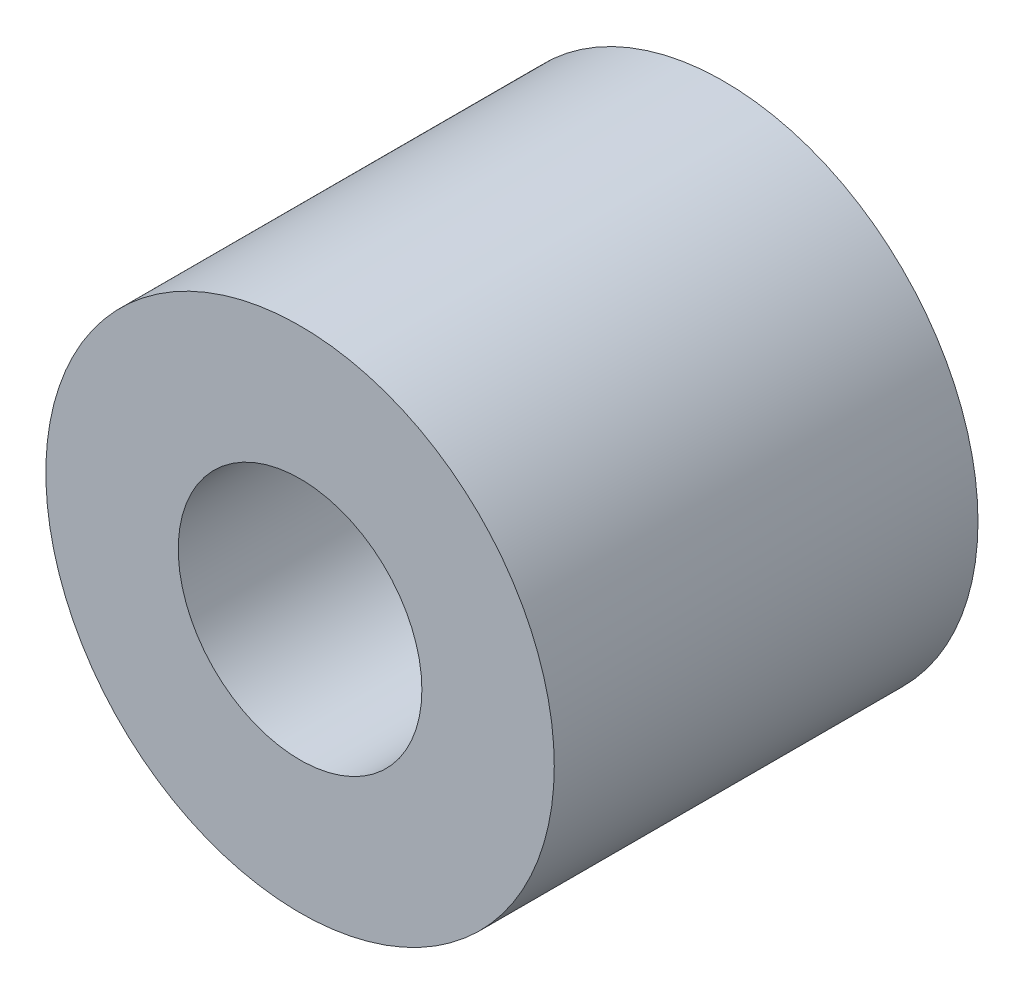
ISO-10303-21;
HEADER;
FILE_DESCRIPTION(('STEP AP214'),'2;1');
FILE_NAME('part.step','',(''),(''),'','','');
FILE_SCHEMA(('AUTOMOTIVE_DESIGN { 1 0 10303 214 1 1 1 1 }'));
ENDSEC;
DATA;
#1=APPLICATION_CONTEXT('core data for automotive mechanical design processes');
#2=APPLICATION_PROTOCOL_DEFINITION('international standard','automotive_design',2000,#1);
#3=PRODUCT_CONTEXT('',#1,'mechanical');
#4=PRODUCT('Part','Part','',(#3));
#5=PRODUCT_RELATED_PRODUCT_CATEGORY('part','',(#4));
#6=PRODUCT_DEFINITION_FORMATION('','',#4);
#7=PRODUCT_DEFINITION_CONTEXT('part definition',#1,'design');
#8=PRODUCT_DEFINITION('design','',#6,#7);
#9=PRODUCT_DEFINITION_SHAPE('','',#8);
#10=(LENGTH_UNIT() NAMED_UNIT(*) SI_UNIT(.MILLI.,.METRE.));
#11=(NAMED_UNIT(*) PLANE_ANGLE_UNIT() SI_UNIT($,.RADIAN.));
#12=(NAMED_UNIT(*) SI_UNIT($,.STERADIAN.) SOLID_ANGLE_UNIT());
#13=UNCERTAINTY_MEASURE_WITH_UNIT(LENGTH_MEASURE(1.E-05),#10,'distance_accuracy_value','');
#14=(GEOMETRIC_REPRESENTATION_CONTEXT(3) GLOBAL_UNCERTAINTY_ASSIGNED_CONTEXT((#13)) GLOBAL_UNIT_ASSIGNED_CONTEXT((#10,
#11,#12)) REPRESENTATION_CONTEXT('',''));
#15=CARTESIAN_POINT('',(0.,0.,0.));
#16=DIRECTION('',(0.,0.,1.));
#17=DIRECTION('',(1.,0.,0.));
#18=AXIS2_PLACEMENT_3D('',#15,#16,#17);
#19=CARTESIAN_POINT('',(0.,0.,4.));
#20=DIRECTION('',(0.,0.,1.));
#21=DIRECTION('',(1.,0.,0.));
#22=AXIS2_PLACEMENT_3D('',#19,#20,#21);
#23=PLANE('',#22);
#24=CARTESIAN_POINT('',(0.,0.,4.));
#25=DIRECTION('',(0.,0.,1.));
#26=DIRECTION('',(1.,0.,0.));
#27=AXIS2_PLACEMENT_3D('',#24,#25,#26);
#28=CIRCLE('',#27,2.4);
#29=CARTESIAN_POINT('',(2.4,0.,4.));
#30=VERTEX_POINT('',#29);
#31=EDGE_CURVE('E10',#30,#30,#28,.T.);
#32=ORIENTED_EDGE('',*,*,#31,.T.);
#33=EDGE_LOOP('',(#32));
#34=FACE_BOUND('',#33,.T.);
#35=CARTESIAN_POINT('',(0.,0.,4.));
#36=DIRECTION('',(0.,0.,1.));
#37=DIRECTION('',(1.,0.,0.));
#38=AXIS2_PLACEMENT_3D('',#35,#36,#37);
#39=CIRCLE('',#38,1.15);
#40=CARTESIAN_POINT('',(1.15,0.,4.));
#41=VERTEX_POINT('',#40);
#42=EDGE_CURVE('E50',#41,#41,#39,.T.);
#43=ORIENTED_EDGE('',*,*,#42,.F.);
#44=EDGE_LOOP('',(#43));
#45=FACE_BOUND('',#44,.T.);
#46=ADVANCED_FACE('F37',(#34,#45),#23,.T.);
#47=CARTESIAN_POINT('',(0.,0.,0.));
#48=DIRECTION('',(0.,0.,1.));
#49=DIRECTION('',(1.,0.,0.));
#50=AXIS2_PLACEMENT_3D('',#47,#48,#49);
#51=PLANE('',#50);
#52=CARTESIAN_POINT('',(0.,0.,0.));
#53=DIRECTION('',(0.,0.,1.));
#54=DIRECTION('',(1.,0.,0.));
#55=AXIS2_PLACEMENT_3D('',#52,#53,#54);
#56=CIRCLE('',#55,2.4);
#57=CARTESIAN_POINT('',(2.4,0.,0.));
#58=VERTEX_POINT('',#57);
#59=EDGE_CURVE('E41',#58,#58,#56,.T.);
#60=ORIENTED_EDGE('',*,*,#59,.F.);
#61=EDGE_LOOP('',(#60));
#62=FACE_BOUND('',#61,.T.);
#63=CARTESIAN_POINT('',(0.,0.,0.));
#64=DIRECTION('',(0.,0.,1.));
#65=DIRECTION('',(1.,0.,0.));
#66=AXIS2_PLACEMENT_3D('',#63,#64,#65);
#67=CIRCLE('',#66,1.15);
#68=CARTESIAN_POINT('',(1.15,0.,0.));
#69=VERTEX_POINT('',#68);
#70=EDGE_CURVE('E52',#69,#69,#67,.T.);
#71=ORIENTED_EDGE('',*,*,#70,.T.);
#72=EDGE_LOOP('',(#71));
#73=FACE_BOUND('',#72,.T.);
#74=ADVANCED_FACE('F64',(#62,#73),#51,.F.);
#75=CARTESIAN_POINT('',(0.,0.,4.));
#76=DIRECTION('',(0.,0.,-1.));
#77=DIRECTION('',(-1.,0.,0.));
#78=AXIS2_PLACEMENT_3D('',#75,#76,#77);
#79=CYLINDRICAL_SURFACE('',#78,2.4);
#80=ORIENTED_EDGE('',*,*,#31,.F.);
#81=EDGE_LOOP('',(#80));
#82=FACE_BOUND('',#81,.T.);
#83=ORIENTED_EDGE('',*,*,#59,.T.);
#84=EDGE_LOOP('',(#83));
#85=FACE_BOUND('',#84,.T.);
#86=ADVANCED_FACE('F39',(#82,#85),#79,.T.);
#87=CARTESIAN_POINT('',(0.,0.,4.));
#88=DIRECTION('',(0.,0.,-1.));
#89=DIRECTION('',(-1.,0.,0.));
#90=AXIS2_PLACEMENT_3D('',#87,#88,#89);
#91=CYLINDRICAL_SURFACE('',#90,1.15);
#92=ORIENTED_EDGE('',*,*,#42,.T.);
#93=EDGE_LOOP('',(#92));
#94=FACE_BOUND('',#93,.T.);
#95=ORIENTED_EDGE('',*,*,#70,.F.);
#96=EDGE_LOOP('',(#95));
#97=FACE_BOUND('',#96,.T.);
#98=ADVANCED_FACE('F60',(#94,#97),#91,.F.);
#99=CLOSED_SHELL('',(#46,#74,#86,#98));
#100=MANIFOLD_SOLID_BREP('B2',#99);
#101=ADVANCED_BREP_SHAPE_REPRESENTATION('',(#18,#100),#14);
#102=SHAPE_DEFINITION_REPRESENTATION(#9,#101);
ENDSEC;
END-ISO-10303-21;
